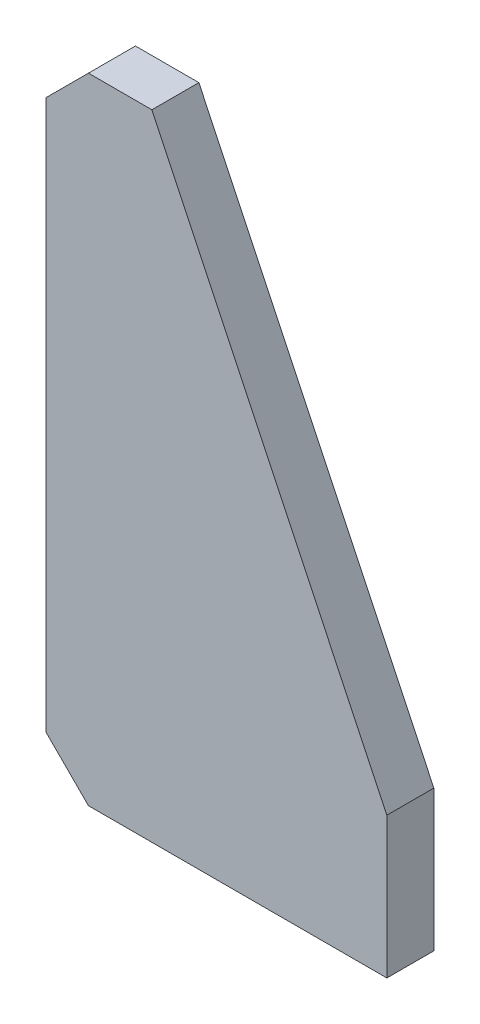
ISO-10303-21;
HEADER;
FILE_DESCRIPTION(('STEP AP214'),'2;1');
FILE_NAME('part.step','',(''),(''),'','','');
FILE_SCHEMA(('AUTOMOTIVE_DESIGN { 1 0 10303 214 1 1 1 1 }'));
ENDSEC;
DATA;
#1=APPLICATION_CONTEXT('core data for automotive mechanical design processes');
#2=APPLICATION_PROTOCOL_DEFINITION('international standard','automotive_design',2000,#1);
#3=PRODUCT_CONTEXT('',#1,'mechanical');
#4=PRODUCT('Part','Part','',(#3));
#5=PRODUCT_RELATED_PRODUCT_CATEGORY('part','',(#4));
#6=PRODUCT_DEFINITION_FORMATION('','',#4);
#7=PRODUCT_DEFINITION_CONTEXT('part definition',#1,'design');
#8=PRODUCT_DEFINITION('design','',#6,#7);
#9=PRODUCT_DEFINITION_SHAPE('','',#8);
#10=(LENGTH_UNIT() NAMED_UNIT(*) SI_UNIT(.MILLI.,.METRE.));
#11=(NAMED_UNIT(*) PLANE_ANGLE_UNIT() SI_UNIT($,.RADIAN.));
#12=(NAMED_UNIT(*) SI_UNIT($,.STERADIAN.) SOLID_ANGLE_UNIT());
#13=UNCERTAINTY_MEASURE_WITH_UNIT(LENGTH_MEASURE(1.E-05),#10,'distance_accuracy_value','');
#14=(GEOMETRIC_REPRESENTATION_CONTEXT(3) GLOBAL_UNCERTAINTY_ASSIGNED_CONTEXT((#13)) GLOBAL_UNIT_ASSIGNED_CONTEXT((#10,
#11,#12)) REPRESENTATION_CONTEXT('',''));
#15=CARTESIAN_POINT('',(0.,0.,0.));
#16=DIRECTION('',(0.,0.,1.));
#17=DIRECTION('',(1.,0.,0.));
#18=AXIS2_PLACEMENT_3D('',#15,#16,#17);
#19=CARTESIAN_POINT('',(-127.,0.,20.));
#20=DIRECTION('',(0.,1.,0.));
#21=DIRECTION('',(0.,0.,1.));
#22=AXIS2_PLACEMENT_3D('',#19,#20,#21);
#23=PLANE('',#22);
#24=DIRECTION('',(1.,0.,0.));
#25=VECTOR('',#24,1.);
#26=CARTESIAN_POINT('',(-127.,0.,0.));
#27=LINE('',#26,#25);
#28=CARTESIAN_POINT('',(-127.,0.,0.));
#29=VERTEX_POINT('',#28);
#30=CARTESIAN_POINT('',(0.,0.,0.));
#31=VERTEX_POINT('',#30);
#32=EDGE_CURVE('E127',#29,#31,#27,.T.);
#33=ORIENTED_EDGE('',*,*,#32,.T.);
#34=DIRECTION('',(0.,0.,-1.));
#35=VECTOR('',#34,1.);
#36=CARTESIAN_POINT('',(0.,0.,20.));
#37=LINE('',#36,#35);
#38=CARTESIAN_POINT('',(0.,0.,20.));
#39=VERTEX_POINT('',#38);
#40=EDGE_CURVE('E11',#39,#31,#37,.T.);
#41=ORIENTED_EDGE('',*,*,#40,.F.);
#42=DIRECTION('',(1.,0.,0.));
#43=VECTOR('',#42,1.);
#44=CARTESIAN_POINT('',(-127.,0.,20.));
#45=LINE('',#44,#43);
#46=CARTESIAN_POINT('',(-127.,0.,20.));
#47=VERTEX_POINT('',#46);
#48=EDGE_CURVE('E139',#47,#39,#45,.T.);
#49=ORIENTED_EDGE('',*,*,#48,.F.);
#50=DIRECTION('',(0.,0.,-1.));
#51=VECTOR('',#50,1.);
#52=CARTESIAN_POINT('',(-127.,0.,20.));
#53=LINE('',#52,#51);
#54=EDGE_CURVE('E123',#47,#29,#53,.T.);
#55=ORIENTED_EDGE('',*,*,#54,.T.);
#56=EDGE_LOOP('',(#33,#41,#49,#55));
#57=FACE_BOUND('',#56,.T.);
#58=ADVANCED_FACE('F37',(#57),#23,.F.);
#59=CARTESIAN_POINT('',(0.,0.,20.));
#60=DIRECTION('',(-1.,0.,0.));
#61=DIRECTION('',(0.,0.,1.));
#62=AXIS2_PLACEMENT_3D('',#59,#60,#61);
#63=PLANE('',#62);
#64=DIRECTION('',(0.,1.,0.));
#65=VECTOR('',#64,1.);
#66=CARTESIAN_POINT('',(0.,0.,0.));
#67=LINE('',#66,#65);
#68=CARTESIAN_POINT('',(0.,60.,0.));
#69=VERTEX_POINT('',#68);
#70=EDGE_CURVE('E130',#31,#69,#67,.T.);
#71=ORIENTED_EDGE('',*,*,#70,.T.);
#72=DIRECTION('',(0.,0.,-1.));
#73=VECTOR('',#72,1.);
#74=CARTESIAN_POINT('',(0.,60.,20.));
#75=LINE('',#74,#73);
#76=CARTESIAN_POINT('',(0.,60.,20.));
#77=VERTEX_POINT('',#76);
#78=EDGE_CURVE('E45',#77,#69,#75,.T.);
#79=ORIENTED_EDGE('',*,*,#78,.F.);
#80=DIRECTION('',(0.,1.,0.));
#81=VECTOR('',#80,1.);
#82=CARTESIAN_POINT('',(0.,0.,20.));
#83=LINE('',#82,#81);
#84=EDGE_CURVE('E93',#39,#77,#83,.T.);
#85=ORIENTED_EDGE('',*,*,#84,.F.);
#86=ORIENTED_EDGE('',*,*,#40,.T.);
#87=EDGE_LOOP('',(#71,#79,#85,#86));
#88=FACE_BOUND('',#87,.T.);
#89=ADVANCED_FACE('F164',(#88),#63,.F.);
#90=CARTESIAN_POINT('',(0.,60.,20.));
#91=DIRECTION('',(-0.90286051882393,-0.429933580392348,0.));
#92=DIRECTION('',(0.429933580392348,-0.90286051882393,0.));
#93=AXIS2_PLACEMENT_3D('',#90,#91,#92);
#94=PLANE('',#93);
#95=DIRECTION('',(-0.429933580392348,0.90286051882393,0.));
#96=VECTOR('',#95,1.);
#97=CARTESIAN_POINT('',(0.,60.,0.));
#98=LINE('',#97,#96);
#99=CARTESIAN_POINT('',(-100.,270.,0.));
#100=VERTEX_POINT('',#99);
#101=EDGE_CURVE('E132',#69,#100,#98,.T.);
#102=ORIENTED_EDGE('',*,*,#101,.T.);
#103=DIRECTION('',(0.,0.,-1.));
#104=VECTOR('',#103,1.);
#105=CARTESIAN_POINT('',(-100.,270.,20.));
#106=LINE('',#105,#104);
#107=CARTESIAN_POINT('',(-100.,270.,20.));
#108=VERTEX_POINT('',#107);
#109=EDGE_CURVE('E143',#108,#100,#106,.T.);
#110=ORIENTED_EDGE('',*,*,#109,.F.);
#111=DIRECTION('',(-0.429933580392348,0.90286051882393,0.));
#112=VECTOR('',#111,1.);
#113=CARTESIAN_POINT('',(0.,60.,20.));
#114=LINE('',#113,#112);
#115=EDGE_CURVE('E151',#77,#108,#114,.T.);
#116=ORIENTED_EDGE('',*,*,#115,.F.);
#117=ORIENTED_EDGE('',*,*,#78,.T.);
#118=EDGE_LOOP('',(#102,#110,#116,#117));
#119=FACE_BOUND('',#118,.T.);
#120=ADVANCED_FACE('F149',(#119),#94,.F.);
#121=CARTESIAN_POINT('',(-100.,270.,20.));
#122=DIRECTION('',(0.,-1.,0.));
#123=DIRECTION('',(0.,0.,-1.));
#124=AXIS2_PLACEMENT_3D('',#121,#122,#123);
#125=PLANE('',#124);
#126=DIRECTION('',(-1.,0.,0.));
#127=VECTOR('',#126,1.);
#128=CARTESIAN_POINT('',(-100.,270.,0.));
#129=LINE('',#128,#127);
#130=CARTESIAN_POINT('',(-127.,270.,0.));
#131=VERTEX_POINT('',#130);
#132=EDGE_CURVE('E134',#100,#131,#129,.T.);
#133=ORIENTED_EDGE('',*,*,#132,.T.);
#134=DIRECTION('',(0.,0.,-1.));
#135=VECTOR('',#134,1.);
#136=CARTESIAN_POINT('',(-127.,270.,20.));
#137=LINE('',#136,#135);
#138=CARTESIAN_POINT('',(-127.,270.,20.));
#139=VERTEX_POINT('',#138);
#140=EDGE_CURVE('E118',#139,#131,#137,.T.);
#141=ORIENTED_EDGE('',*,*,#140,.F.);
#142=DIRECTION('',(-1.,0.,0.));
#143=VECTOR('',#142,1.);
#144=CARTESIAN_POINT('',(-100.,270.,20.));
#145=LINE('',#144,#143);
#146=EDGE_CURVE('E109',#108,#139,#145,.T.);
#147=ORIENTED_EDGE('',*,*,#146,.F.);
#148=ORIENTED_EDGE('',*,*,#109,.T.);
#149=EDGE_LOOP('',(#133,#141,#147,#148));
#150=FACE_BOUND('',#149,.T.);
#151=ADVANCED_FACE('F157',(#150),#125,.F.);
#152=CARTESIAN_POINT('',(-127.,270.,20.));
#153=DIRECTION('',(0.70710678118655,-0.707106781186545,0.));
#154=DIRECTION('',(0.707106781186545,0.70710678118655,0.));
#155=AXIS2_PLACEMENT_3D('',#152,#153,#154);
#156=PLANE('',#155);
#157=DIRECTION('',(-0.707106781186545,-0.70710678118655,0.));
#158=VECTOR('',#157,1.);
#159=CARTESIAN_POINT('',(-127.,270.,0.));
#160=LINE('',#159,#158);
#161=CARTESIAN_POINT('',(-145.,252.,0.));
#162=VERTEX_POINT('',#161);
#163=EDGE_CURVE('E117',#131,#162,#160,.T.);
#164=ORIENTED_EDGE('',*,*,#163,.T.);
#165=DIRECTION('',(0.,0.,-1.));
#166=VECTOR('',#165,1.);
#167=CARTESIAN_POINT('',(-145.,252.,20.));
#168=LINE('',#167,#166);
#169=CARTESIAN_POINT('',(-145.,252.,20.));
#170=VERTEX_POINT('',#169);
#171=EDGE_CURVE('E114',#170,#162,#168,.T.);
#172=ORIENTED_EDGE('',*,*,#171,.F.);
#173=DIRECTION('',(-0.707106781186545,-0.70710678118655,0.));
#174=VECTOR('',#173,1.);
#175=CARTESIAN_POINT('',(-127.,270.,20.));
#176=LINE('',#175,#174);
#177=EDGE_CURVE('E103',#139,#170,#176,.T.);
#178=ORIENTED_EDGE('',*,*,#177,.F.);
#179=ORIENTED_EDGE('',*,*,#140,.T.);
#180=EDGE_LOOP('',(#164,#172,#178,#179));
#181=FACE_BOUND('',#180,.T.);
#182=ADVANCED_FACE('F115',(#181),#156,.F.);
#183=CARTESIAN_POINT('',(-145.,252.,20.));
#184=DIRECTION('',(1.,0.,0.));
#185=DIRECTION('',(0.,0.,-1.));
#186=AXIS2_PLACEMENT_3D('',#183,#184,#185);
#187=PLANE('',#186);
#188=DIRECTION('',(0.,-1.,0.));
#189=VECTOR('',#188,1.);
#190=CARTESIAN_POINT('',(-145.,252.,0.));
#191=LINE('',#190,#189);
#192=CARTESIAN_POINT('',(-145.,18.,0.));
#193=VERTEX_POINT('',#192);
#194=EDGE_CURVE('E79',#162,#193,#191,.T.);
#195=ORIENTED_EDGE('',*,*,#194,.T.);
#196=DIRECTION('',(0.,0.,-1.));
#197=VECTOR('',#196,1.);
#198=CARTESIAN_POINT('',(-145.,18.,20.));
#199=LINE('',#198,#197);
#200=CARTESIAN_POINT('',(-145.,18.,20.));
#201=VERTEX_POINT('',#200);
#202=EDGE_CURVE('E119',#201,#193,#199,.T.);
#203=ORIENTED_EDGE('',*,*,#202,.F.);
#204=DIRECTION('',(0.,-1.,0.));
#205=VECTOR('',#204,1.);
#206=CARTESIAN_POINT('',(-145.,252.,20.));
#207=LINE('',#206,#205);
#208=EDGE_CURVE('E107',#170,#201,#207,.T.);
#209=ORIENTED_EDGE('',*,*,#208,.F.);
#210=ORIENTED_EDGE('',*,*,#171,.T.);
#211=EDGE_LOOP('',(#195,#203,#209,#210));
#212=FACE_BOUND('',#211,.T.);
#213=ADVANCED_FACE('F121',(#212),#187,.F.);
#214=CARTESIAN_POINT('',(-127.,0.,20.));
#215=DIRECTION('',(0.707106781186548,0.707106781186547,0.));
#216=DIRECTION('',(-0.707106781186547,0.707106781186548,0.));
#217=AXIS2_PLACEMENT_3D('',#214,#215,#216);
#218=PLANE('',#217);
#219=DIRECTION('',(0.707106781186547,-0.707106781186548,0.));
#220=VECTOR('',#219,1.);
#221=CARTESIAN_POINT('',(-127.,0.,0.));
#222=LINE('',#221,#220);
#223=EDGE_CURVE('E85',#193,#29,#222,.T.);
#224=ORIENTED_EDGE('',*,*,#223,.T.);
#225=ORIENTED_EDGE('',*,*,#54,.F.);
#226=DIRECTION('',(0.707106781186547,-0.707106781186548,0.));
#227=VECTOR('',#226,1.);
#228=CARTESIAN_POINT('',(-127.,0.,20.));
#229=LINE('',#228,#227);
#230=EDGE_CURVE('E53',#201,#47,#229,.T.);
#231=ORIENTED_EDGE('',*,*,#230,.F.);
#232=ORIENTED_EDGE('',*,*,#202,.T.);
#233=EDGE_LOOP('',(#224,#225,#231,#232));
#234=FACE_BOUND('',#233,.T.);
#235=ADVANCED_FACE('F178',(#234),#218,.F.);
#236=CARTESIAN_POINT('',(0.,0.,20.));
#237=DIRECTION('',(0.,0.,1.));
#238=DIRECTION('',(1.,0.,0.));
#239=AXIS2_PLACEMENT_3D('',#236,#237,#238);
#240=PLANE('',#239);
#241=ORIENTED_EDGE('',*,*,#48,.T.);
#242=ORIENTED_EDGE('',*,*,#84,.T.);
#243=ORIENTED_EDGE('',*,*,#115,.T.);
#244=ORIENTED_EDGE('',*,*,#146,.T.);
#245=ORIENTED_EDGE('',*,*,#177,.T.);
#246=ORIENTED_EDGE('',*,*,#208,.T.);
#247=ORIENTED_EDGE('',*,*,#230,.T.);
#248=EDGE_LOOP('',(#241,#242,#243,#244,#245,#246,#247));
#249=FACE_BOUND('',#248,.T.);
#250=ADVANCED_FACE('F105',(#249),#240,.T.);
#251=CARTESIAN_POINT('',(0.,0.,0.));
#252=DIRECTION('',(0.,0.,1.));
#253=DIRECTION('',(1.,0.,0.));
#254=AXIS2_PLACEMENT_3D('',#251,#252,#253);
#255=PLANE('',#254);
#256=ORIENTED_EDGE('',*,*,#32,.F.);
#257=ORIENTED_EDGE('',*,*,#223,.F.);
#258=ORIENTED_EDGE('',*,*,#194,.F.);
#259=ORIENTED_EDGE('',*,*,#163,.F.);
#260=ORIENTED_EDGE('',*,*,#132,.F.);
#261=ORIENTED_EDGE('',*,*,#101,.F.);
#262=ORIENTED_EDGE('',*,*,#70,.F.);
#263=EDGE_LOOP('',(#256,#257,#258,#259,#260,#261,#262));
#264=FACE_BOUND('',#263,.T.);
#265=ADVANCED_FACE('F155',(#264),#255,.F.);
#266=CLOSED_SHELL('',(#58,#89,#120,#151,#182,#213,#235,#250,#265));
#267=MANIFOLD_SOLID_BREP('B2',#266);
#268=ADVANCED_BREP_SHAPE_REPRESENTATION('',(#18,#267),#14);
#269=SHAPE_DEFINITION_REPRESENTATION(#9,#268);
ENDSEC;
END-ISO-10303-21;
